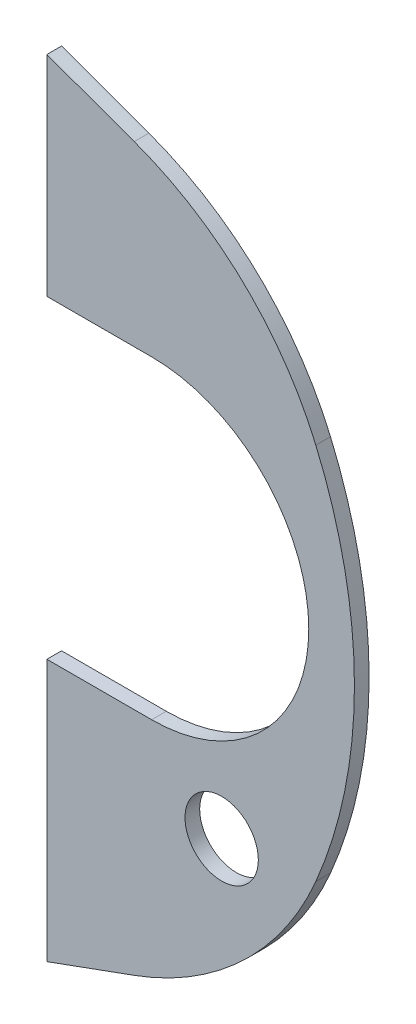
ISO-10303-21;
HEADER;
FILE_DESCRIPTION(('STEP AP214'),'2;1');
FILE_NAME('part.step','',(''),(''),'','','');
FILE_SCHEMA(('AUTOMOTIVE_DESIGN { 1 0 10303 214 1 1 1 1 }'));
ENDSEC;
DATA;
#1=APPLICATION_CONTEXT('core data for automotive mechanical design processes');
#2=APPLICATION_PROTOCOL_DEFINITION('international standard','automotive_design',2000,#1);
#3=PRODUCT_CONTEXT('',#1,'mechanical');
#4=PRODUCT('Part','Part','',(#3));
#5=PRODUCT_RELATED_PRODUCT_CATEGORY('part','',(#4));
#6=PRODUCT_DEFINITION_FORMATION('','',#4);
#7=PRODUCT_DEFINITION_CONTEXT('part definition',#1,'design');
#8=PRODUCT_DEFINITION('design','',#6,#7);
#9=PRODUCT_DEFINITION_SHAPE('','',#8);
#10=(LENGTH_UNIT() NAMED_UNIT(*) SI_UNIT(.MILLI.,.METRE.));
#11=(NAMED_UNIT(*) PLANE_ANGLE_UNIT() SI_UNIT($,.RADIAN.));
#12=(NAMED_UNIT(*) SI_UNIT($,.STERADIAN.) SOLID_ANGLE_UNIT());
#13=UNCERTAINTY_MEASURE_WITH_UNIT(LENGTH_MEASURE(1.E-05),#10,'distance_accuracy_value','');
#14=(GEOMETRIC_REPRESENTATION_CONTEXT(3) GLOBAL_UNCERTAINTY_ASSIGNED_CONTEXT((#13)) GLOBAL_UNIT_ASSIGNED_CONTEXT((#10,
#11,#12)) REPRESENTATION_CONTEXT('',''));
#15=CARTESIAN_POINT('',(0.,0.,0.));
#16=DIRECTION('',(0.,0.,1.));
#17=DIRECTION('',(1.,0.,0.));
#18=AXIS2_PLACEMENT_3D('',#15,#16,#17);
#19=CARTESIAN_POINT('',(0.,0.,0.7));
#20=DIRECTION('',(1.,0.,0.));
#21=DIRECTION('',(0.,0.,-1.));
#22=AXIS2_PLACEMENT_3D('',#19,#20,#21);
#23=PLANE('',#22);
#24=DIRECTION('',(0.,-1.,0.));
#25=VECTOR('',#24,1.);
#26=CARTESIAN_POINT('',(0.,0.,0.));
#27=LINE('',#26,#25);
#28=CARTESIAN_POINT('',(0.,12.5,0.));
#29=VERTEX_POINT('',#28);
#30=CARTESIAN_POINT('',(0.,0.,0.));
#31=VERTEX_POINT('',#30);
#32=EDGE_CURVE('E150',#29,#31,#27,.T.);
#33=ORIENTED_EDGE('',*,*,#32,.T.);
#34=DIRECTION('',(0.,0.,-1.));
#35=VECTOR('',#34,1.);
#36=CARTESIAN_POINT('',(0.,0.,0.7));
#37=LINE('',#36,#35);
#38=CARTESIAN_POINT('',(0.,0.,0.7));
#39=VERTEX_POINT('',#38);
#40=EDGE_CURVE('E122',#39,#31,#37,.T.);
#41=ORIENTED_EDGE('',*,*,#40,.F.);
#42=DIRECTION('',(0.,-1.,0.));
#43=VECTOR('',#42,1.);
#44=CARTESIAN_POINT('',(0.,0.,0.7));
#45=LINE('',#44,#43);
#46=CARTESIAN_POINT('',(0.,12.5,0.7));
#47=VERTEX_POINT('',#46);
#48=EDGE_CURVE('E142',#47,#39,#45,.T.);
#49=ORIENTED_EDGE('',*,*,#48,.F.);
#50=DIRECTION('',(0.,0.,-1.));
#51=VECTOR('',#50,1.);
#52=CARTESIAN_POINT('',(0.,12.5,0.7));
#53=LINE('',#52,#51);
#54=EDGE_CURVE('E149',#47,#29,#53,.T.);
#55=ORIENTED_EDGE('',*,*,#54,.T.);
#56=EDGE_LOOP('',(#33,#41,#49,#55));
#57=FACE_BOUND('',#56,.T.);
#58=ADVANCED_FACE('F38',(#57),#23,.F.);
#59=CARTESIAN_POINT('',(-8.32056680475721,18.75,0.7));
#60=DIRECTION('',(0.,0.,-1.));
#61=DIRECTION('',(-1.,0.,0.));
#62=AXIS2_PLACEMENT_3D('',#59,#60,#61);
#63=CYLINDRICAL_SURFACE('',#62,23.);
#64=CARTESIAN_POINT('',(-8.32056680475721,18.75,0.));
#65=DIRECTION('',(0.,0.,1.));
#66=DIRECTION('',(-1.,0.,0.));
#67=AXIS2_PLACEMENT_3D('',#64,#65,#66);
#68=CIRCLE('',#67,23.);
#69=CARTESIAN_POINT('',(12.8371068428424,9.73041875574756,0.));
#70=VERTEX_POINT('',#69);
#71=CARTESIAN_POINT('',(12.8371068428423,27.7695812442525,0.));
#72=VERTEX_POINT('',#71);
#73=EDGE_CURVE('E153',#70,#72,#68,.T.);
#74=ORIENTED_EDGE('',*,*,#73,.T.);
#75=DIRECTION('',(0.,0.,-1.));
#76=VECTOR('',#75,1.);
#77=CARTESIAN_POINT('',(12.8371068428423,27.7695812442525,0.7));
#78=LINE('',#77,#76);
#79=CARTESIAN_POINT('',(12.8371068428423,27.7695812442525,0.7));
#80=VERTEX_POINT('',#79);
#81=EDGE_CURVE('E182',#72,#80,#78,.F.);
#82=ORIENTED_EDGE('',*,*,#81,.T.);
#83=CARTESIAN_POINT('',(-8.32056680475721,18.75,0.7));
#84=DIRECTION('',(0.,0.,1.));
#85=DIRECTION('',(-1.,0.,0.));
#86=AXIS2_PLACEMENT_3D('',#83,#84,#85);
#87=CIRCLE('',#86,23.);
#88=CARTESIAN_POINT('',(12.8371068428424,9.73041875574756,0.7));
#89=VERTEX_POINT('',#88);
#90=EDGE_CURVE('E138',#89,#80,#87,.T.);
#91=ORIENTED_EDGE('',*,*,#90,.F.);
#92=DIRECTION('',(0.,0.,-1.));
#93=VECTOR('',#92,1.);
#94=CARTESIAN_POINT('',(12.8371068428424,9.73041875574756,0.7));
#95=LINE('',#94,#93);
#96=EDGE_CURVE('E179',#89,#70,#95,.T.);
#97=ORIENTED_EDGE('',*,*,#96,.T.);
#98=EDGE_LOOP('',(#74,#82,#91,#97));
#99=FACE_BOUND('',#98,.T.);
#100=ADVANCED_FACE('F195',(#99),#63,.T.);
#101=CARTESIAN_POINT('',(0.,27.5,0.7));
#102=DIRECTION('',(1.,0.,0.));
#103=DIRECTION('',(0.,0.,-1.));
#104=AXIS2_PLACEMENT_3D('',#101,#102,#103);
#105=PLANE('',#104);
#106=DIRECTION('',(0.,-1.,0.));
#107=VECTOR('',#106,1.);
#108=CARTESIAN_POINT('',(0.,27.5,0.));
#109=LINE('',#108,#107);
#110=CARTESIAN_POINT('',(0.,37.5,0.));
#111=VERTEX_POINT('',#110);
#112=CARTESIAN_POINT('',(0.,27.5,0.));
#113=VERTEX_POINT('',#112);
#114=EDGE_CURVE('E156',#111,#113,#109,.T.);
#115=ORIENTED_EDGE('',*,*,#114,.T.);
#116=DIRECTION('',(0.,0.,-1.));
#117=VECTOR('',#116,1.);
#118=CARTESIAN_POINT('',(0.,27.5,0.7));
#119=LINE('',#118,#117);
#120=CARTESIAN_POINT('',(0.,27.5,0.7));
#121=VERTEX_POINT('',#120);
#122=EDGE_CURVE('E123',#121,#113,#119,.T.);
#123=ORIENTED_EDGE('',*,*,#122,.F.);
#124=DIRECTION('',(0.,-1.,0.));
#125=VECTOR('',#124,1.);
#126=CARTESIAN_POINT('',(0.,27.5,0.7));
#127=LINE('',#126,#125);
#128=CARTESIAN_POINT('',(0.,37.5,0.7));
#129=VERTEX_POINT('',#128);
#130=EDGE_CURVE('E128',#129,#121,#127,.T.);
#131=ORIENTED_EDGE('',*,*,#130,.F.);
#132=DIRECTION('',(0.,0.,-1.));
#133=VECTOR('',#132,1.);
#134=CARTESIAN_POINT('',(0.,37.5,0.7));
#135=LINE('',#134,#133);
#136=EDGE_CURVE('E114',#129,#111,#135,.T.);
#137=ORIENTED_EDGE('',*,*,#136,.T.);
#138=EDGE_LOOP('',(#115,#123,#131,#137));
#139=FACE_BOUND('',#138,.T.);
#140=ADVANCED_FACE('F134',(#139),#105,.F.);
#141=CARTESIAN_POINT('',(0.,27.5,0.7));
#142=DIRECTION('',(0.,1.,0.));
#143=DIRECTION('',(0.,0.,1.));
#144=AXIS2_PLACEMENT_3D('',#141,#142,#143);
#145=PLANE('',#144);
#146=DIRECTION('',(1.,0.,0.));
#147=VECTOR('',#146,1.);
#148=CARTESIAN_POINT('',(0.,27.5,0.));
#149=LINE('',#148,#147);
#150=CARTESIAN_POINT('',(5.,27.5,0.));
#151=VERTEX_POINT('',#150);
#152=EDGE_CURVE('E158',#113,#151,#149,.T.);
#153=ORIENTED_EDGE('',*,*,#152,.T.);
#154=DIRECTION('',(0.,0.,-1.));
#155=VECTOR('',#154,1.);
#156=CARTESIAN_POINT('',(5.,27.5,0.7));
#157=LINE('',#156,#155);
#158=CARTESIAN_POINT('',(5.,27.5,0.7));
#159=VERTEX_POINT('',#158);
#160=EDGE_CURVE('E169',#159,#151,#157,.T.);
#161=ORIENTED_EDGE('',*,*,#160,.F.);
#162=DIRECTION('',(1.,0.,0.));
#163=VECTOR('',#162,1.);
#164=CARTESIAN_POINT('',(0.,27.5,0.7));
#165=LINE('',#164,#163);
#166=EDGE_CURVE('E137',#121,#159,#165,.T.);
#167=ORIENTED_EDGE('',*,*,#166,.F.);
#168=ORIENTED_EDGE('',*,*,#122,.T.);
#169=EDGE_LOOP('',(#153,#161,#167,#168));
#170=FACE_BOUND('',#169,.T.);
#171=ADVANCED_FACE('F217',(#170),#145,.F.);
#172=CARTESIAN_POINT('',(5.,20.,0.7));
#173=DIRECTION('',(0.,0.,-1.));
#174=DIRECTION('',(-1.,0.,0.));
#175=AXIS2_PLACEMENT_3D('',#172,#173,#174);
#176=CYLINDRICAL_SURFACE('',#175,7.5);
#177=CARTESIAN_POINT('',(5.,20.,0.));
#178=DIRECTION('',(0.,0.,-1.));
#179=DIRECTION('',(-1.,0.,0.));
#180=AXIS2_PLACEMENT_3D('',#177,#178,#179);
#181=CIRCLE('',#180,7.5);
#182=CARTESIAN_POINT('',(5.,12.5,0.));
#183=VERTEX_POINT('',#182);
#184=EDGE_CURVE('E160',#151,#183,#181,.T.);
#185=ORIENTED_EDGE('',*,*,#184,.T.);
#186=DIRECTION('',(0.,0.,-1.));
#187=VECTOR('',#186,1.);
#188=CARTESIAN_POINT('',(5.,12.5,0.7));
#189=LINE('',#188,#187);
#190=CARTESIAN_POINT('',(5.,12.5,0.7));
#191=VERTEX_POINT('',#190);
#192=EDGE_CURVE('E166',#191,#183,#189,.T.);
#193=ORIENTED_EDGE('',*,*,#192,.F.);
#194=CARTESIAN_POINT('',(5.,20.,0.7));
#195=DIRECTION('',(0.,0.,-1.));
#196=DIRECTION('',(-1.,0.,0.));
#197=AXIS2_PLACEMENT_3D('',#194,#195,#196);
#198=CIRCLE('',#197,7.5);
#199=EDGE_CURVE('E140',#159,#191,#198,.T.);
#200=ORIENTED_EDGE('',*,*,#199,.F.);
#201=ORIENTED_EDGE('',*,*,#160,.T.);
#202=EDGE_LOOP('',(#185,#193,#200,#201));
#203=FACE_BOUND('',#202,.T.);
#204=ADVANCED_FACE('F220',(#203),#176,.F.);
#205=CARTESIAN_POINT('',(0.,12.5,0.7));
#206=DIRECTION('',(0.,-1.,0.));
#207=DIRECTION('',(0.,0.,-1.));
#208=AXIS2_PLACEMENT_3D('',#205,#206,#207);
#209=PLANE('',#208);
#210=DIRECTION('',(-1.,0.,0.));
#211=VECTOR('',#210,1.);
#212=CARTESIAN_POINT('',(0.,12.5,0.));
#213=LINE('',#212,#211);
#214=EDGE_CURVE('E162',#183,#29,#213,.T.);
#215=ORIENTED_EDGE('',*,*,#214,.T.);
#216=ORIENTED_EDGE('',*,*,#54,.F.);
#217=DIRECTION('',(-1.,0.,0.));
#218=VECTOR('',#217,1.);
#219=CARTESIAN_POINT('',(0.,12.5,0.7));
#220=LINE('',#219,#218);
#221=EDGE_CURVE('E147',#191,#47,#220,.T.);
#222=ORIENTED_EDGE('',*,*,#221,.F.);
#223=ORIENTED_EDGE('',*,*,#192,.T.);
#224=EDGE_LOOP('',(#215,#216,#222,#223));
#225=FACE_BOUND('',#224,.T.);
#226=ADVANCED_FACE('F224',(#225),#209,.F.);
#227=CARTESIAN_POINT('',(5.,20.,0.7));
#228=DIRECTION('',(0.,0.,-1.));
#229=DIRECTION('',(-1.,0.,0.));
#230=AXIS2_PLACEMENT_3D('',#227,#228,#229);
#231=PLANE('',#230);
#232=CARTESIAN_POINT('',(8.34200055473142,9.25262746044332,0.7));
#233=DIRECTION('',(0.,0.,1.));
#234=DIRECTION('',(1.,0.,0.));
#235=AXIS2_PLACEMENT_3D('',#232,#233,#234);
#236=CIRCLE('',#235,1.75);
#237=CARTESIAN_POINT('',(10.0920005547314,9.25262746044332,0.7));
#238=VERTEX_POINT('',#237);
#239=EDGE_CURVE('E249',#238,#238,#236,.T.);
#240=ORIENTED_EDGE('',*,*,#239,.F.);
#241=EDGE_LOOP('',(#240));
#242=FACE_BOUND('',#241,.T.);
#243=ORIENTED_EDGE('',*,*,#90,.T.);
#244=CARTESIAN_POINT('',(-0.961375970809551,21.8872456501748,0.7));
#245=DIRECTION('',(0.,0.,-1.));
#246=DIRECTION('',(-1.,0.,0.));
#247=AXIS2_PLACEMENT_3D('',#244,#245,#246);
#248=CIRCLE('',#247,15.);
#249=CARTESIAN_POINT('',(4.16892617907539,35.9826349619635,0.7));
#250=VERTEX_POINT('',#249);
#251=EDGE_CURVE('E130',#80,#250,#248,.F.);
#252=ORIENTED_EDGE('',*,*,#251,.T.);
#253=DIRECTION('',(0.939692620785911,-0.342020143325663,0.));
#254=VECTOR('',#253,1.);
#255=CARTESIAN_POINT('',(0.,37.5,0.7));
#256=LINE('',#255,#254);
#257=EDGE_CURVE('E117',#129,#250,#256,.T.);
#258=ORIENTED_EDGE('',*,*,#257,.F.);
#259=ORIENTED_EDGE('',*,*,#130,.T.);
#260=ORIENTED_EDGE('',*,*,#166,.T.);
#261=ORIENTED_EDGE('',*,*,#199,.T.);
#262=ORIENTED_EDGE('',*,*,#221,.T.);
#263=ORIENTED_EDGE('',*,*,#48,.T.);
#264=DIRECTION('',(-0.939692620785908,-0.342020143325669,0.));
#265=VECTOR('',#264,1.);
#266=CARTESIAN_POINT('',(0.,0.,0.7));
#267=LINE('',#266,#265);
#268=CARTESIAN_POINT('',(4.16892617907551,1.51736503803662,0.7));
#269=VERTEX_POINT('',#268);
#270=EDGE_CURVE('E132',#269,#39,#267,.T.);
#271=ORIENTED_EDGE('',*,*,#270,.F.);
#272=CARTESIAN_POINT('',(-0.961375970809534,15.6127543498252,0.7));
#273=DIRECTION('',(0.,0.,-1.));
#274=DIRECTION('',(-1.,0.,0.));
#275=AXIS2_PLACEMENT_3D('',#272,#273,#274);
#276=CIRCLE('',#275,15.);
#277=EDGE_CURVE('E185',#269,#89,#276,.F.);
#278=ORIENTED_EDGE('',*,*,#277,.T.);
#279=EDGE_LOOP('',(#243,#252,#258,#259,#260,#261,#262,#263,#271,#278));
#280=FACE_BOUND('',#279,.T.);
#281=ADVANCED_FACE('F127',(#242,#280),#231,.F.);
#282=CARTESIAN_POINT('',(5.,20.,0.));
#283=DIRECTION('',(0.,0.,-1.));
#284=DIRECTION('',(-1.,0.,0.));
#285=AXIS2_PLACEMENT_3D('',#282,#283,#284);
#286=PLANE('',#285);
#287=DIRECTION('',(-0.939692620785911,0.342020143325663,0.));
#288=VECTOR('',#287,1.);
#289=CARTESIAN_POINT('',(10.0395026925546,33.8459198530748,0.));
#290=LINE('',#289,#288);
#291=CARTESIAN_POINT('',(4.16892617907539,35.9826349619635,0.));
#292=VERTEX_POINT('',#291);
#293=EDGE_CURVE('E118',#292,#111,#290,.T.);
#294=ORIENTED_EDGE('',*,*,#293,.F.);
#295=CARTESIAN_POINT('',(-0.961375970809551,21.8872456501748,0.));
#296=DIRECTION('',(0.,0.,-1.));
#297=DIRECTION('',(-1.,0.,0.));
#298=AXIS2_PLACEMENT_3D('',#295,#296,#297);
#299=CIRCLE('',#298,15.);
#300=EDGE_CURVE('E46',#292,#72,#299,.T.);
#301=ORIENTED_EDGE('',*,*,#300,.T.);
#302=ORIENTED_EDGE('',*,*,#73,.F.);
#303=CARTESIAN_POINT('',(-0.961375970809534,15.6127543498252,0.));
#304=DIRECTION('',(0.,0.,-1.));
#305=DIRECTION('',(-1.,0.,0.));
#306=AXIS2_PLACEMENT_3D('',#303,#304,#305);
#307=CIRCLE('',#306,15.);
#308=CARTESIAN_POINT('',(4.16892617907551,1.51736503803662,0.));
#309=VERTEX_POINT('',#308);
#310=EDGE_CURVE('E53',#70,#309,#307,.T.);
#311=ORIENTED_EDGE('',*,*,#310,.T.);
#312=DIRECTION('',(0.939692620785908,0.342020143325669,0.));
#313=VECTOR('',#312,1.);
#314=CARTESIAN_POINT('',(10.8429872046628,3.94652459302658,0.));
#315=LINE('',#314,#313);
#316=EDGE_CURVE('E174',#31,#309,#315,.T.);
#317=ORIENTED_EDGE('',*,*,#316,.F.);
#318=ORIENTED_EDGE('',*,*,#32,.F.);
#319=ORIENTED_EDGE('',*,*,#214,.F.);
#320=ORIENTED_EDGE('',*,*,#184,.F.);
#321=ORIENTED_EDGE('',*,*,#152,.F.);
#322=ORIENTED_EDGE('',*,*,#114,.F.);
#323=EDGE_LOOP('',(#294,#301,#302,#311,#317,#318,#319,#320,#321,#322));
#324=FACE_BOUND('',#323,.T.);
#325=CARTESIAN_POINT('',(8.34200055473142,9.25262746044332,0.));
#326=DIRECTION('',(0.,0.,-1.));
#327=DIRECTION('',(-1.,0.,0.));
#328=AXIS2_PLACEMENT_3D('',#325,#326,#327);
#329=CIRCLE('',#328,1.75);
#330=CARTESIAN_POINT('',(6.59200055473142,9.25262746044332,0.));
#331=VERTEX_POINT('',#330);
#332=EDGE_CURVE('E131',#331,#331,#329,.T.);
#333=ORIENTED_EDGE('',*,*,#332,.F.);
#334=EDGE_LOOP('',(#333));
#335=FACE_BOUND('',#334,.T.);
#336=ADVANCED_FACE('F190',(#324,#335),#286,.T.);
#337=CARTESIAN_POINT('',(8.34200055473142,9.25262746044332,-9.3));
#338=DIRECTION('',(0.,0.,1.));
#339=DIRECTION('',(1.,0.,0.));
#340=AXIS2_PLACEMENT_3D('',#337,#338,#339);
#341=CYLINDRICAL_SURFACE('',#340,1.75);
#342=ORIENTED_EDGE('',*,*,#332,.T.);
#343=EDGE_LOOP('',(#342));
#344=FACE_BOUND('',#343,.T.);
#345=ORIENTED_EDGE('',*,*,#239,.T.);
#346=EDGE_LOOP('',(#345));
#347=FACE_BOUND('',#346,.T.);
#348=ADVANCED_FACE('F231',(#344,#347),#341,.F.);
#349=CARTESIAN_POINT('',(0.,0.,-9.3));
#350=DIRECTION('',(-0.342020143325669,0.939692620785908,0.));
#351=DIRECTION('',(-0.939692620785908,-0.342020143325669,0.));
#352=AXIS2_PLACEMENT_3D('',#349,#350,#351);
#353=PLANE('',#352);
#354=ORIENTED_EDGE('',*,*,#316,.T.);
#355=DIRECTION('',(0.,0.,-1.));
#356=VECTOR('',#355,1.);
#357=CARTESIAN_POINT('',(4.16892617907551,1.51736503803662,-9.3));
#358=LINE('',#357,#356);
#359=EDGE_CURVE('E11',#309,#269,#358,.F.);
#360=ORIENTED_EDGE('',*,*,#359,.T.);
#361=ORIENTED_EDGE('',*,*,#270,.T.);
#362=ORIENTED_EDGE('',*,*,#40,.T.);
#363=EDGE_LOOP('',(#354,#360,#361,#362));
#364=FACE_BOUND('',#363,.T.);
#365=ADVANCED_FACE('F205',(#364),#353,.F.);
#366=CARTESIAN_POINT('',(0.,37.5,-9.3));
#367=DIRECTION('',(-0.342020143325663,-0.93969262078591,0.));
#368=DIRECTION('',(0.939692620785911,-0.342020143325663,0.));
#369=AXIS2_PLACEMENT_3D('',#366,#367,#368);
#370=PLANE('',#369);
#371=ORIENTED_EDGE('',*,*,#257,.T.);
#372=DIRECTION('',(0.,0.,-1.));
#373=VECTOR('',#372,1.);
#374=CARTESIAN_POINT('',(4.16892617907539,35.9826349619635,-9.3));
#375=LINE('',#374,#373);
#376=EDGE_CURVE('E61',#250,#292,#375,.T.);
#377=ORIENTED_EDGE('',*,*,#376,.T.);
#378=ORIENTED_EDGE('',*,*,#293,.T.);
#379=ORIENTED_EDGE('',*,*,#136,.F.);
#380=EDGE_LOOP('',(#371,#377,#378,#379));
#381=FACE_BOUND('',#380,.T.);
#382=ADVANCED_FACE('F116',(#381),#370,.F.);
#383=CARTESIAN_POINT('',(-0.961375970809551,21.8872456501748,0.7));
#384=DIRECTION('',(0.,0.,-1.));
#385=DIRECTION('',(-1.,0.,0.));
#386=AXIS2_PLACEMENT_3D('',#383,#384,#385);
#387=CYLINDRICAL_SURFACE('',#386,15.);
#388=ORIENTED_EDGE('',*,*,#300,.F.);
#389=ORIENTED_EDGE('',*,*,#376,.F.);
#390=ORIENTED_EDGE('',*,*,#251,.F.);
#391=ORIENTED_EDGE('',*,*,#81,.F.);
#392=EDGE_LOOP('',(#388,#389,#390,#391));
#393=FACE_BOUND('',#392,.T.);
#394=ADVANCED_FACE('F198',(#393),#387,.T.);
#395=CARTESIAN_POINT('',(-0.961375970809534,15.6127543498252,0.7));
#396=DIRECTION('',(0.,0.,-1.));
#397=DIRECTION('',(-1.,0.,0.));
#398=AXIS2_PLACEMENT_3D('',#395,#396,#397);
#399=CYLINDRICAL_SURFACE('',#398,15.);
#400=ORIENTED_EDGE('',*,*,#277,.F.);
#401=ORIENTED_EDGE('',*,*,#359,.F.);
#402=ORIENTED_EDGE('',*,*,#310,.F.);
#403=ORIENTED_EDGE('',*,*,#96,.F.);
#404=EDGE_LOOP('',(#400,#401,#402,#403));
#405=FACE_BOUND('',#404,.T.);
#406=ADVANCED_FACE('F40',(#405),#399,.T.);
#407=CLOSED_SHELL('',(#58,#100,#140,#171,#204,#226,#281,#336,#348,#365,#382,#394,#406));
#408=MANIFOLD_SOLID_BREP('B2',#407);
#409=ADVANCED_BREP_SHAPE_REPRESENTATION('',(#18,#408),#14);
#410=SHAPE_DEFINITION_REPRESENTATION(#9,#409);
ENDSEC;
END-ISO-10303-21;
